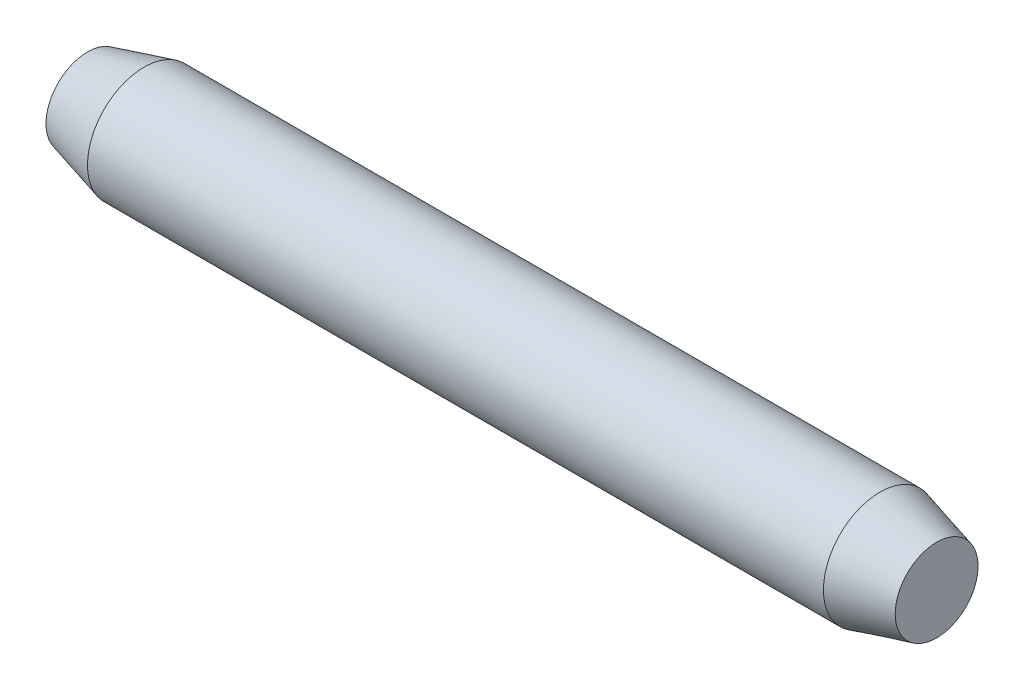
ISO-10303-21;
HEADER;
FILE_DESCRIPTION(('STEP AP214'),'2;1');
FILE_NAME('part.step','',(''),(''),'','','');
FILE_SCHEMA(('AUTOMOTIVE_DESIGN { 1 0 10303 214 1 1 1 1 }'));
ENDSEC;
DATA;
#1=APPLICATION_CONTEXT('core data for automotive mechanical design processes');
#2=APPLICATION_PROTOCOL_DEFINITION('international standard','automotive_design',2000,#1);
#3=PRODUCT_CONTEXT('',#1,'mechanical');
#4=PRODUCT('Part','Part','',(#3));
#5=PRODUCT_RELATED_PRODUCT_CATEGORY('part','',(#4));
#6=PRODUCT_DEFINITION_FORMATION('','',#4);
#7=PRODUCT_DEFINITION_CONTEXT('part definition',#1,'design');
#8=PRODUCT_DEFINITION('design','',#6,#7);
#9=PRODUCT_DEFINITION_SHAPE('','',#8);
#10=(LENGTH_UNIT() NAMED_UNIT(*) SI_UNIT(.MILLI.,.METRE.));
#11=(NAMED_UNIT(*) PLANE_ANGLE_UNIT() SI_UNIT($,.RADIAN.));
#12=(NAMED_UNIT(*) SI_UNIT($,.STERADIAN.) SOLID_ANGLE_UNIT());
#13=UNCERTAINTY_MEASURE_WITH_UNIT(LENGTH_MEASURE(1.E-05),#10,'distance_accuracy_value','');
#14=(GEOMETRIC_REPRESENTATION_CONTEXT(3) GLOBAL_UNCERTAINTY_ASSIGNED_CONTEXT((#13)) GLOBAL_UNIT_ASSIGNED_CONTEXT((#10,
#11,#12)) REPRESENTATION_CONTEXT('',''));
#15=CARTESIAN_POINT('',(0.,0.,0.));
#16=DIRECTION('',(0.,0.,1.));
#17=DIRECTION('',(1.,0.,0.));
#18=AXIS2_PLACEMENT_3D('',#15,#16,#17);
#19=CARTESIAN_POINT('',(0.,0.732050807568882,0.));
#20=DIRECTION('',(1.,0.,0.));
#21=DIRECTION('',(0.,0.,-1.));
#22=AXIS2_PLACEMENT_3D('',#19,#20,#21);
#23=PLANE('',#22);
#24=CARTESIAN_POINT('',(0.,0.,0.));
#25=DIRECTION('',(-1.,0.,0.));
#26=DIRECTION('',(0.,0.,1.));
#27=AXIS2_PLACEMENT_3D('',#24,#25,#26);
#28=CIRCLE('',#27,0.732050807568882);
#29=CARTESIAN_POINT('',(0.,0.,0.732050807568882));
#30=VERTEX_POINT('',#29);
#31=EDGE_CURVE('E10',#30,#30,#28,.T.);
#32=ORIENTED_EDGE('',*,*,#31,.T.);
#33=EDGE_LOOP('',(#32));
#34=FACE_BOUND('',#33,.T.);
#35=ADVANCED_FACE('F31',(#34),#23,.F.);
#36=CARTESIAN_POINT('',(1.,0.,0.));
#37=DIRECTION('',(1.,0.,0.));
#38=DIRECTION('',(0.,0.,-1.));
#39=AXIS2_PLACEMENT_3D('',#36,#37,#38);
#40=CONICAL_SURFACE('',#39,0.999999999999998,0.261799387799143);
#41=ORIENTED_EDGE('',*,*,#31,.F.);
#42=EDGE_LOOP('',(#41));
#43=FACE_BOUND('',#42,.T.);
#44=CARTESIAN_POINT('',(1.,0.,0.));
#45=DIRECTION('',(-1.,0.,0.));
#46=DIRECTION('',(0.,0.,1.));
#47=AXIS2_PLACEMENT_3D('',#44,#45,#46);
#48=CIRCLE('',#47,0.999999999999998);
#49=CARTESIAN_POINT('',(1.,0.,0.999999999999998));
#50=VERTEX_POINT('',#49);
#51=EDGE_CURVE('E37',#50,#50,#48,.T.);
#52=ORIENTED_EDGE('',*,*,#51,.T.);
#53=EDGE_LOOP('',(#52));
#54=FACE_BOUND('',#53,.T.);
#55=ADVANCED_FACE('F63',(#43,#54),#40,.T.);
#56=CARTESIAN_POINT('',(-6.35,0.,0.));
#57=DIRECTION('',(-1.,0.,0.));
#58=DIRECTION('',(0.,0.,1.));
#59=AXIS2_PLACEMENT_3D('',#56,#57,#58);
#60=CYLINDRICAL_SURFACE('',#59,1.);
#61=ORIENTED_EDGE('',*,*,#51,.F.);
#62=EDGE_LOOP('',(#61));
#63=FACE_BOUND('',#62,.T.);
#64=CARTESIAN_POINT('',(14.,0.,0.));
#65=DIRECTION('',(-1.,0.,0.));
#66=DIRECTION('',(0.,0.,1.));
#67=AXIS2_PLACEMENT_3D('',#64,#65,#66);
#68=CIRCLE('',#67,1.);
#69=CARTESIAN_POINT('',(14.,0.,1.));
#70=VERTEX_POINT('',#69);
#71=EDGE_CURVE('E41',#70,#70,#68,.T.);
#72=ORIENTED_EDGE('',*,*,#71,.T.);
#73=EDGE_LOOP('',(#72));
#74=FACE_BOUND('',#73,.T.);
#75=ADVANCED_FACE('F59',(#63,#74),#60,.T.);
#76=CARTESIAN_POINT('',(15.,0.,0.));
#77=DIRECTION('',(-1.,0.,0.));
#78=DIRECTION('',(0.,0.,1.));
#79=AXIS2_PLACEMENT_3D('',#76,#77,#78);
#80=CONICAL_SURFACE('',#79,0.732050807568877,0.26179938779915);
#81=ORIENTED_EDGE('',*,*,#71,.F.);
#82=EDGE_LOOP('',(#81));
#83=FACE_BOUND('',#82,.T.);
#84=CARTESIAN_POINT('',(15.,0.,0.));
#85=DIRECTION('',(-1.,0.,0.));
#86=DIRECTION('',(0.,0.,1.));
#87=AXIS2_PLACEMENT_3D('',#84,#85,#86);
#88=CIRCLE('',#87,0.732050807568877);
#89=CARTESIAN_POINT('',(15.,0.,0.732050807568877));
#90=VERTEX_POINT('',#89);
#91=EDGE_CURVE('E45',#90,#90,#88,.T.);
#92=ORIENTED_EDGE('',*,*,#91,.T.);
#93=EDGE_LOOP('',(#92));
#94=FACE_BOUND('',#93,.T.);
#95=ADVANCED_FACE('F51',(#83,#94),#80,.T.);
#96=CARTESIAN_POINT('',(15.,0.,0.));
#97=DIRECTION('',(-1.,0.,0.));
#98=DIRECTION('',(0.,0.,1.));
#99=AXIS2_PLACEMENT_3D('',#96,#97,#98);
#100=PLANE('',#99);
#101=ORIENTED_EDGE('',*,*,#91,.F.);
#102=EDGE_LOOP('',(#101));
#103=FACE_BOUND('',#102,.T.);
#104=ADVANCED_FACE('F53',(#103),#100,.F.);
#105=CLOSED_SHELL('',(#35,#55,#75,#95,#104));
#106=MANIFOLD_SOLID_BREP('B2',#105);
#107=ADVANCED_BREP_SHAPE_REPRESENTATION('',(#18,#106),#14);
#108=SHAPE_DEFINITION_REPRESENTATION(#9,#107);
ENDSEC;
END-ISO-10303-21;
